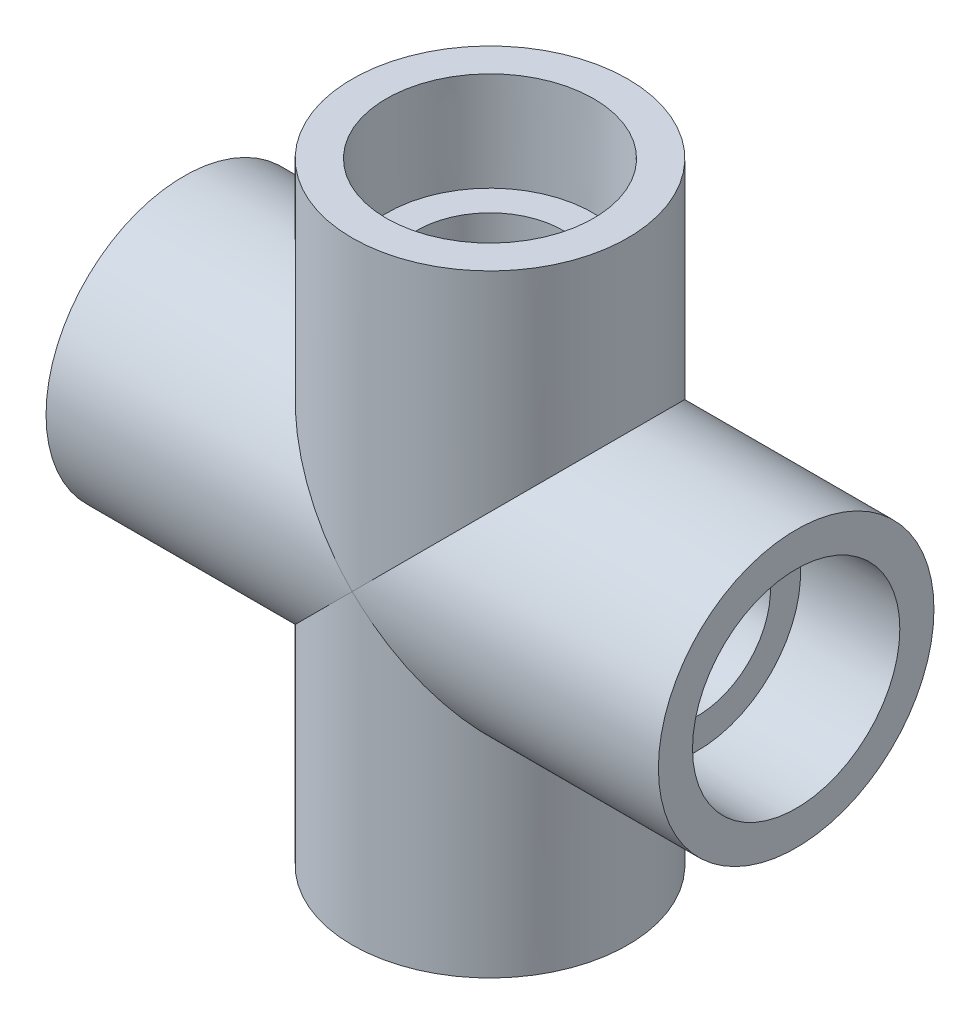
ISO-10303-21;
HEADER;
FILE_DESCRIPTION(('STEP AP214'),'2;1');
FILE_NAME('part.step','',(''),(''),'','','');
FILE_SCHEMA(('AUTOMOTIVE_DESIGN { 1 0 10303 214 1 1 1 1 }'));
ENDSEC;
DATA;
#1=APPLICATION_CONTEXT('core data for automotive mechanical design processes');
#2=APPLICATION_PROTOCOL_DEFINITION('international standard','automotive_design',2000,#1);
#3=PRODUCT_CONTEXT('',#1,'mechanical');
#4=PRODUCT('Part','Part','',(#3));
#5=PRODUCT_RELATED_PRODUCT_CATEGORY('part','',(#4));
#6=PRODUCT_DEFINITION_FORMATION('','',#4);
#7=PRODUCT_DEFINITION_CONTEXT('part definition',#1,'design');
#8=PRODUCT_DEFINITION('design','',#6,#7);
#9=PRODUCT_DEFINITION_SHAPE('','',#8);
#10=(LENGTH_UNIT() NAMED_UNIT(*) SI_UNIT(.MILLI.,.METRE.));
#11=(NAMED_UNIT(*) PLANE_ANGLE_UNIT() SI_UNIT($,.RADIAN.));
#12=(NAMED_UNIT(*) SI_UNIT($,.STERADIAN.) SOLID_ANGLE_UNIT());
#13=UNCERTAINTY_MEASURE_WITH_UNIT(LENGTH_MEASURE(1.E-05),#10,'distance_accuracy_value','');
#14=(GEOMETRIC_REPRESENTATION_CONTEXT(3) GLOBAL_UNCERTAINTY_ASSIGNED_CONTEXT((#13)) GLOBAL_UNIT_ASSIGNED_CONTEXT((#10,
#11,#12)) REPRESENTATION_CONTEXT('',''));
#15=CARTESIAN_POINT('',(0.,0.,0.));
#16=DIRECTION('',(0.,0.,1.));
#17=DIRECTION('',(1.,0.,0.));
#18=AXIS2_PLACEMENT_3D('',#15,#16,#17);
#19=CARTESIAN_POINT('',(-39.6875,-17.859375,0.));
#20=DIRECTION('',(-1.,0.,0.));
#21=DIRECTION('',(0.,0.,1.));
#22=AXIS2_PLACEMENT_3D('',#19,#20,#21);
#23=PLANE('',#22);
#24=CARTESIAN_POINT('',(-39.6875,0.,0.));
#25=DIRECTION('',(-1.,0.,0.));
#26=DIRECTION('',(0.,0.,1.));
#27=AXIS2_PLACEMENT_3D('',#24,#25,#26);
#28=CIRCLE('',#27,17.859375);
#29=CARTESIAN_POINT('',(-39.6875,0.,17.859375));
#30=VERTEX_POINT('',#29);
#31=EDGE_CURVE('E134',#30,#30,#28,.T.);
#32=ORIENTED_EDGE('',*,*,#31,.T.);
#33=EDGE_LOOP('',(#32));
#34=FACE_BOUND('',#33,.T.);
#35=CARTESIAN_POINT('',(-39.6875,0.,0.));
#36=DIRECTION('',(-1.,0.,0.));
#37=DIRECTION('',(0.,0.,1.));
#38=AXIS2_PLACEMENT_3D('',#35,#36,#37);
#39=CIRCLE('',#38,13.4366);
#40=CARTESIAN_POINT('',(-39.6875,0.,13.4366));
#41=VERTEX_POINT('',#40);
#42=EDGE_CURVE('E11',#41,#41,#39,.T.);
#43=ORIENTED_EDGE('',*,*,#42,.F.);
#44=EDGE_LOOP('',(#43));
#45=FACE_BOUND('',#44,.T.);
#46=ADVANCED_FACE('F41',(#34,#45),#23,.T.);
#47=CARTESIAN_POINT('',(-26.924,0.,0.));
#48=DIRECTION('',(-1.,0.,0.));
#49=DIRECTION('',(0.,0.,1.));
#50=AXIS2_PLACEMENT_3D('',#47,#48,#49);
#51=CONICAL_SURFACE('',#50,13.335,0.00796003087931212);
#52=ORIENTED_EDGE('',*,*,#42,.T.);
#53=EDGE_LOOP('',(#52));
#54=FACE_BOUND('',#53,.T.);
#55=CARTESIAN_POINT('',(-26.924,0.,0.));
#56=DIRECTION('',(-1.,0.,0.));
#57=DIRECTION('',(0.,0.,1.));
#58=AXIS2_PLACEMENT_3D('',#55,#56,#57);
#59=CIRCLE('',#58,13.335);
#60=CARTESIAN_POINT('',(-26.924,0.,13.335));
#61=VERTEX_POINT('',#60);
#62=EDGE_CURVE('E48',#61,#61,#59,.T.);
#63=ORIENTED_EDGE('',*,*,#62,.F.);
#64=EDGE_LOOP('',(#63));
#65=FACE_BOUND('',#64,.T.);
#66=ADVANCED_FACE('F145',(#54,#65),#51,.F.);
#67=CARTESIAN_POINT('',(-26.924,-9.4234,0.));
#68=DIRECTION('',(-1.,0.,0.));
#69=DIRECTION('',(0.,0.,1.));
#70=AXIS2_PLACEMENT_3D('',#67,#68,#69);
#71=PLANE('',#70);
#72=ORIENTED_EDGE('',*,*,#62,.T.);
#73=EDGE_LOOP('',(#72));
#74=FACE_BOUND('',#73,.T.);
#75=CARTESIAN_POINT('',(-26.924,0.,0.));
#76=DIRECTION('',(-1.,0.,0.));
#77=DIRECTION('',(0.,0.,1.));
#78=AXIS2_PLACEMENT_3D('',#75,#76,#77);
#79=CIRCLE('',#78,9.4234);
#80=CARTESIAN_POINT('',(-26.924,0.,9.4234));
#81=VERTEX_POINT('',#80);
#82=EDGE_CURVE('E137',#81,#81,#79,.T.);
#83=ORIENTED_EDGE('',*,*,#82,.F.);
#84=EDGE_LOOP('',(#83));
#85=FACE_BOUND('',#84,.T.);
#86=ADVANCED_FACE('F142',(#74,#85),#71,.T.);
#87=CARTESIAN_POINT('',(-39.6875,0.,0.));
#88=DIRECTION('',(-1.,0.,0.));
#89=DIRECTION('',(0.,0.,1.));
#90=AXIS2_PLACEMENT_3D('',#87,#88,#89);
#91=CYLINDRICAL_SURFACE('',#90,9.4234);
#92=CARTESIAN_POINT('',(0.,0.,0.));
#93=DIRECTION('',(0.70710678118655,-0.707106781186545,0.));
#94=DIRECTION('',(-0.707106781186545,-0.70710678118655,0.));
#95=AXIS2_PLACEMENT_3D('',#92,#93,#94);
#96=ELLIPSE('',#95,13.3267000836666,9.4234);
#97=CARTESIAN_POINT('',(0.,0.,9.4234));
#98=VERTEX_POINT('',#97);
#99=CARTESIAN_POINT('',(0.,0.,-9.4234));
#100=VERTEX_POINT('',#99);
#101=EDGE_CURVE('E66',#98,#100,#96,.T.);
#102=ORIENTED_EDGE('',*,*,#101,.T.);
#103=CARTESIAN_POINT('',(0.,0.,0.));
#104=DIRECTION('',(0.70710678118654,0.707106781186555,0.));
#105=DIRECTION('',(-0.707106781186555,0.70710678118654,0.));
#106=AXIS2_PLACEMENT_3D('',#103,#104,#105);
#107=ELLIPSE('',#106,13.3267000836666,9.4234);
#108=EDGE_CURVE('E54',#100,#98,#107,.T.);
#109=ORIENTED_EDGE('',*,*,#108,.T.);
#110=EDGE_LOOP('',(#102,#109));
#111=FACE_BOUND('',#110,.T.);
#112=ORIENTED_EDGE('',*,*,#82,.T.);
#113=EDGE_LOOP('',(#112));
#114=FACE_BOUND('',#113,.T.);
#115=ADVANCED_FACE('F68',(#111,#114),#91,.F.);
#116=CARTESIAN_POINT('',(-39.6875,0.,0.));
#117=DIRECTION('',(-1.,0.,0.));
#118=DIRECTION('',(0.,0.,1.));
#119=AXIS2_PLACEMENT_3D('',#116,#117,#118);
#120=CYLINDRICAL_SURFACE('',#119,17.859375);
#121=CARTESIAN_POINT('',(0.,0.,0.));
#122=DIRECTION('',(0.70710678118654,0.707106781186555,0.));
#123=DIRECTION('',(-0.707106781186555,0.70710678118654,0.));
#124=AXIS2_PLACEMENT_3D('',#121,#122,#123);
#125=ELLIPSE('',#124,25.256970340507,17.859375);
#126=CARTESIAN_POINT('',(0.,0.,17.859375));
#127=VERTEX_POINT('',#126);
#128=CARTESIAN_POINT('',(0.,0.,-17.859375));
#129=VERTEX_POINT('',#128);
#130=EDGE_CURVE('E61',#127,#129,#125,.F.);
#131=ORIENTED_EDGE('',*,*,#130,.T.);
#132=CARTESIAN_POINT('',(0.,0.,0.));
#133=DIRECTION('',(0.70710678118655,-0.707106781186545,0.));
#134=DIRECTION('',(-0.707106781186545,-0.70710678118655,0.));
#135=AXIS2_PLACEMENT_3D('',#132,#133,#134);
#136=ELLIPSE('',#135,25.256970340507,17.859375);
#137=EDGE_CURVE('E129',#129,#127,#136,.F.);
#138=ORIENTED_EDGE('',*,*,#137,.T.);
#139=EDGE_LOOP('',(#131,#138));
#140=FACE_BOUND('',#139,.T.);
#141=ORIENTED_EDGE('',*,*,#31,.F.);
#142=EDGE_LOOP('',(#141));
#143=FACE_BOUND('',#142,.T.);
#144=ADVANCED_FACE('F157',(#140,#143),#120,.T.);
#145=CARTESIAN_POINT('',(17.8593750000001,-39.6874999999999,0.));
#146=DIRECTION('',(0.,-1.,0.));
#147=DIRECTION('',(0.,0.,1.));
#148=AXIS2_PLACEMENT_3D('',#145,#146,#147);
#149=PLANE('',#148);
#150=CARTESIAN_POINT('',(1.38568165635337E-13,-39.6875,0.));
#151=DIRECTION('',(0.,-1.,0.));
#152=DIRECTION('',(0.,0.,1.));
#153=AXIS2_PLACEMENT_3D('',#150,#151,#152);
#154=CIRCLE('',#153,17.859375);
#155=CARTESIAN_POINT('',(1.38568165635337E-13,-39.6875,17.859375));
#156=VERTEX_POINT('',#155);
#157=EDGE_CURVE('E80',#156,#156,#154,.T.);
#158=ORIENTED_EDGE('',*,*,#157,.T.);
#159=EDGE_LOOP('',(#158));
#160=FACE_BOUND('',#159,.T.);
#161=CARTESIAN_POINT('',(1.38568165635337E-13,-39.6875,0.));
#162=DIRECTION('',(0.,-1.,0.));
#163=DIRECTION('',(0.,0.,1.));
#164=AXIS2_PLACEMENT_3D('',#161,#162,#163);
#165=CIRCLE('',#164,13.4366);
#166=CARTESIAN_POINT('',(1.38568165635337E-13,-39.6875,13.4366));
#167=VERTEX_POINT('',#166);
#168=EDGE_CURVE('E126',#167,#167,#165,.T.);
#169=ORIENTED_EDGE('',*,*,#168,.F.);
#170=EDGE_LOOP('',(#169));
#171=FACE_BOUND('',#170,.T.);
#172=ADVANCED_FACE('F160',(#160,#171),#149,.T.);
#173=CARTESIAN_POINT('',(0.,-26.924,0.));
#174=DIRECTION('',(0.,-1.,0.));
#175=DIRECTION('',(0.,0.,1.));
#176=AXIS2_PLACEMENT_3D('',#173,#174,#175);
#177=CONICAL_SURFACE('',#176,13.335,0.00796003087931212);
#178=ORIENTED_EDGE('',*,*,#168,.T.);
#179=EDGE_LOOP('',(#178));
#180=FACE_BOUND('',#179,.T.);
#181=CARTESIAN_POINT('',(0.,-26.924,0.));
#182=DIRECTION('',(0.,-1.,0.));
#183=DIRECTION('',(0.,0.,1.));
#184=AXIS2_PLACEMENT_3D('',#181,#182,#183);
#185=CIRCLE('',#184,13.335);
#186=CARTESIAN_POINT('',(0.,-26.924,13.335));
#187=VERTEX_POINT('',#186);
#188=EDGE_CURVE('E123',#187,#187,#185,.T.);
#189=ORIENTED_EDGE('',*,*,#188,.F.);
#190=EDGE_LOOP('',(#189));
#191=FACE_BOUND('',#190,.T.);
#192=ADVANCED_FACE('F163',(#180,#191),#177,.F.);
#193=CARTESIAN_POINT('',(9.42340000000009,-26.924,0.));
#194=DIRECTION('',(0.,-1.,0.));
#195=DIRECTION('',(0.,0.,1.));
#196=AXIS2_PLACEMENT_3D('',#193,#194,#195);
#197=PLANE('',#196);
#198=ORIENTED_EDGE('',*,*,#188,.T.);
#199=EDGE_LOOP('',(#198));
#200=FACE_BOUND('',#199,.T.);
#201=CARTESIAN_POINT('',(0.,-26.924,0.));
#202=DIRECTION('',(0.,-1.,0.));
#203=DIRECTION('',(0.,0.,1.));
#204=AXIS2_PLACEMENT_3D('',#201,#202,#203);
#205=CIRCLE('',#204,9.4234);
#206=CARTESIAN_POINT('',(0.,-26.924,9.4234));
#207=VERTEX_POINT('',#206);
#208=EDGE_CURVE('E120',#207,#207,#205,.T.);
#209=ORIENTED_EDGE('',*,*,#208,.F.);
#210=EDGE_LOOP('',(#209));
#211=FACE_BOUND('',#210,.T.);
#212=ADVANCED_FACE('F167',(#200,#211),#197,.T.);
#213=CARTESIAN_POINT('',(1.38568165635337E-13,-39.6875,0.));
#214=DIRECTION('',(0.,-1.,0.));
#215=DIRECTION('',(0.,0.,1.));
#216=AXIS2_PLACEMENT_3D('',#213,#214,#215);
#217=CYLINDRICAL_SURFACE('',#216,9.4234);
#218=CARTESIAN_POINT('',(0.,0.,0.));
#219=DIRECTION('',(-0.707106781186545,-0.70710678118655,0.));
#220=DIRECTION('',(0.70710678118655,-0.707106781186545,0.));
#221=AXIS2_PLACEMENT_3D('',#218,#219,#220);
#222=ELLIPSE('',#221,13.3267000836666,9.4234);
#223=EDGE_CURVE('E72',#100,#98,#222,.T.);
#224=ORIENTED_EDGE('',*,*,#223,.F.);
#225=ORIENTED_EDGE('',*,*,#101,.F.);
#226=EDGE_LOOP('',(#224,#225));
#227=FACE_BOUND('',#226,.T.);
#228=ORIENTED_EDGE('',*,*,#208,.T.);
#229=EDGE_LOOP('',(#228));
#230=FACE_BOUND('',#229,.T.);
#231=ADVANCED_FACE('F76',(#227,#230),#217,.F.);
#232=CARTESIAN_POINT('',(1.38568165635337E-13,-39.6875,0.));
#233=DIRECTION('',(0.,-1.,0.));
#234=DIRECTION('',(0.,0.,1.));
#235=AXIS2_PLACEMENT_3D('',#232,#233,#234);
#236=CYLINDRICAL_SURFACE('',#235,17.859375);
#237=ORIENTED_EDGE('',*,*,#137,.F.);
#238=CARTESIAN_POINT('',(0.,0.,0.));
#239=DIRECTION('',(-0.707106781186545,-0.70710678118655,0.));
#240=DIRECTION('',(0.70710678118655,-0.707106781186545,0.));
#241=AXIS2_PLACEMENT_3D('',#238,#239,#240);
#242=ELLIPSE('',#241,25.256970340507,17.859375);
#243=EDGE_CURVE('E131',#127,#129,#242,.F.);
#244=ORIENTED_EDGE('',*,*,#243,.F.);
#245=EDGE_LOOP('',(#237,#244));
#246=FACE_BOUND('',#245,.T.);
#247=ORIENTED_EDGE('',*,*,#157,.F.);
#248=EDGE_LOOP('',(#247));
#249=FACE_BOUND('',#248,.T.);
#250=ADVANCED_FACE('F174',(#246,#249),#236,.T.);
#251=CARTESIAN_POINT('',(39.6875,17.859375,0.));
#252=DIRECTION('',(1.,0.,0.));
#253=DIRECTION('',(0.,0.,1.));
#254=AXIS2_PLACEMENT_3D('',#251,#252,#253);
#255=PLANE('',#254);
#256=CARTESIAN_POINT('',(39.6875,0.,0.));
#257=DIRECTION('',(1.,0.,0.));
#258=DIRECTION('',(0.,0.,1.));
#259=AXIS2_PLACEMENT_3D('',#256,#257,#258);
#260=CIRCLE('',#259,17.859375);
#261=CARTESIAN_POINT('',(39.6875,0.,17.859375));
#262=VERTEX_POINT('',#261);
#263=EDGE_CURVE('E86',#262,#262,#260,.T.);
#264=ORIENTED_EDGE('',*,*,#263,.T.);
#265=EDGE_LOOP('',(#264));
#266=FACE_BOUND('',#265,.T.);
#267=CARTESIAN_POINT('',(39.6875,0.,0.));
#268=DIRECTION('',(1.,0.,0.));
#269=DIRECTION('',(0.,0.,1.));
#270=AXIS2_PLACEMENT_3D('',#267,#268,#269);
#271=CIRCLE('',#270,13.4366);
#272=CARTESIAN_POINT('',(39.6875,0.,13.4366));
#273=VERTEX_POINT('',#272);
#274=EDGE_CURVE('E113',#273,#273,#271,.T.);
#275=ORIENTED_EDGE('',*,*,#274,.F.);
#276=EDGE_LOOP('',(#275));
#277=FACE_BOUND('',#276,.T.);
#278=ADVANCED_FACE('F177',(#266,#277),#255,.T.);
#279=CARTESIAN_POINT('',(26.924,0.,0.));
#280=DIRECTION('',(1.,0.,0.));
#281=DIRECTION('',(0.,0.,1.));
#282=AXIS2_PLACEMENT_3D('',#279,#280,#281);
#283=CONICAL_SURFACE('',#282,13.335,0.00796003087931212);
#284=ORIENTED_EDGE('',*,*,#274,.T.);
#285=EDGE_LOOP('',(#284));
#286=FACE_BOUND('',#285,.T.);
#287=CARTESIAN_POINT('',(26.924,0.,0.));
#288=DIRECTION('',(1.,0.,0.));
#289=DIRECTION('',(0.,0.,1.));
#290=AXIS2_PLACEMENT_3D('',#287,#288,#289);
#291=CIRCLE('',#290,13.335);
#292=CARTESIAN_POINT('',(26.924,0.,13.335));
#293=VERTEX_POINT('',#292);
#294=EDGE_CURVE('E110',#293,#293,#291,.T.);
#295=ORIENTED_EDGE('',*,*,#294,.F.);
#296=EDGE_LOOP('',(#295));
#297=FACE_BOUND('',#296,.T.);
#298=ADVANCED_FACE('F181',(#286,#297),#283,.F.);
#299=CARTESIAN_POINT('',(26.924,9.4234,0.));
#300=DIRECTION('',(1.,0.,0.));
#301=DIRECTION('',(0.,0.,1.));
#302=AXIS2_PLACEMENT_3D('',#299,#300,#301);
#303=PLANE('',#302);
#304=ORIENTED_EDGE('',*,*,#294,.T.);
#305=EDGE_LOOP('',(#304));
#306=FACE_BOUND('',#305,.T.);
#307=CARTESIAN_POINT('',(26.924,0.,0.));
#308=DIRECTION('',(1.,0.,0.));
#309=DIRECTION('',(0.,0.,1.));
#310=AXIS2_PLACEMENT_3D('',#307,#308,#309);
#311=CIRCLE('',#310,9.4234);
#312=CARTESIAN_POINT('',(26.924,0.,9.4234));
#313=VERTEX_POINT('',#312);
#314=EDGE_CURVE('E107',#313,#313,#311,.T.);
#315=ORIENTED_EDGE('',*,*,#314,.F.);
#316=EDGE_LOOP('',(#315));
#317=FACE_BOUND('',#316,.T.);
#318=ADVANCED_FACE('F185',(#306,#317),#303,.T.);
#319=CARTESIAN_POINT('',(39.6875,0.,0.));
#320=DIRECTION('',(1.,0.,0.));
#321=DIRECTION('',(0.,0.,1.));
#322=AXIS2_PLACEMENT_3D('',#319,#320,#321);
#323=CYLINDRICAL_SURFACE('',#322,9.4234);
#324=CARTESIAN_POINT('',(0.,0.,0.));
#325=DIRECTION('',(0.707106781186547,-0.707106781186547,0.));
#326=DIRECTION('',(0.707106781186548,0.707106781186548,0.));
#327=AXIS2_PLACEMENT_3D('',#324,#325,#326);
#328=ELLIPSE('',#327,13.3267000836666,9.4234);
#329=EDGE_CURVE('E82',#100,#98,#328,.T.);
#330=ORIENTED_EDGE('',*,*,#329,.F.);
#331=ORIENTED_EDGE('',*,*,#223,.T.);
#332=EDGE_LOOP('',(#330,#331));
#333=FACE_BOUND('',#332,.T.);
#334=ORIENTED_EDGE('',*,*,#314,.T.);
#335=EDGE_LOOP('',(#334));
#336=FACE_BOUND('',#335,.T.);
#337=ADVANCED_FACE('F83',(#333,#336),#323,.F.);
#338=CARTESIAN_POINT('',(39.6875,0.,0.));
#339=DIRECTION('',(1.,0.,0.));
#340=DIRECTION('',(0.,0.,1.));
#341=AXIS2_PLACEMENT_3D('',#338,#339,#340);
#342=CYLINDRICAL_SURFACE('',#341,17.859375);
#343=ORIENTED_EDGE('',*,*,#243,.T.);
#344=CARTESIAN_POINT('',(0.,0.,0.));
#345=DIRECTION('',(0.707106781186547,-0.707106781186547,0.));
#346=DIRECTION('',(0.707106781186548,0.707106781186548,0.));
#347=AXIS2_PLACEMENT_3D('',#344,#345,#346);
#348=ELLIPSE('',#347,25.256970340507,17.859375);
#349=EDGE_CURVE('E73',#127,#129,#348,.F.);
#350=ORIENTED_EDGE('',*,*,#349,.F.);
#351=EDGE_LOOP('',(#343,#350));
#352=FACE_BOUND('',#351,.T.);
#353=ORIENTED_EDGE('',*,*,#263,.F.);
#354=EDGE_LOOP('',(#353));
#355=FACE_BOUND('',#354,.T.);
#356=ADVANCED_FACE('F192',(#352,#355),#342,.T.);
#357=CARTESIAN_POINT('',(-17.8593750000004,39.6874999999998,0.));
#358=DIRECTION('',(0.,1.,0.));
#359=DIRECTION('',(0.,0.,1.));
#360=AXIS2_PLACEMENT_3D('',#357,#358,#359);
#361=PLANE('',#360);
#362=CARTESIAN_POINT('',(-4.1570449690601E-13,39.6875,0.));
#363=DIRECTION('',(0.,1.,0.));
#364=DIRECTION('',(0.,0.,1.));
#365=AXIS2_PLACEMENT_3D('',#362,#363,#364);
#366=CIRCLE('',#365,17.859375);
#367=CARTESIAN_POINT('',(-4.1570449690601E-13,39.6875,17.859375));
#368=VERTEX_POINT('',#367);
#369=EDGE_CURVE('E90',#368,#368,#366,.T.);
#370=ORIENTED_EDGE('',*,*,#369,.T.);
#371=EDGE_LOOP('',(#370));
#372=FACE_BOUND('',#371,.T.);
#373=CARTESIAN_POINT('',(-4.15704496906011E-13,39.6875,0.));
#374=DIRECTION('',(0.,1.,0.));
#375=DIRECTION('',(0.,0.,1.));
#376=AXIS2_PLACEMENT_3D('',#373,#374,#375);
#377=CIRCLE('',#376,13.4366);
#378=CARTESIAN_POINT('',(-4.15704496906011E-13,39.6875,13.4366));
#379=VERTEX_POINT('',#378);
#380=EDGE_CURVE('E101',#379,#379,#377,.T.);
#381=ORIENTED_EDGE('',*,*,#380,.F.);
#382=EDGE_LOOP('',(#381));
#383=FACE_BOUND('',#382,.T.);
#384=ADVANCED_FACE('F195',(#372,#383),#361,.T.);
#385=CARTESIAN_POINT('',(-2.82013930701038E-13,26.924,0.));
#386=DIRECTION('',(0.,1.,0.));
#387=DIRECTION('',(0.,0.,1.));
#388=AXIS2_PLACEMENT_3D('',#385,#386,#387);
#389=CONICAL_SURFACE('',#388,13.335,0.00796003087931212);
#390=ORIENTED_EDGE('',*,*,#380,.T.);
#391=EDGE_LOOP('',(#390));
#392=FACE_BOUND('',#391,.T.);
#393=CARTESIAN_POINT('',(-2.82013930701038E-13,26.924,0.));
#394=DIRECTION('',(0.,1.,0.));
#395=DIRECTION('',(0.,0.,1.));
#396=AXIS2_PLACEMENT_3D('',#393,#394,#395);
#397=CIRCLE('',#396,13.335);
#398=CARTESIAN_POINT('',(-2.82013930701038E-13,26.924,13.335));
#399=VERTEX_POINT('',#398);
#400=EDGE_CURVE('E98',#399,#399,#397,.T.);
#401=ORIENTED_EDGE('',*,*,#400,.F.);
#402=EDGE_LOOP('',(#401));
#403=FACE_BOUND('',#402,.T.);
#404=ADVANCED_FACE('F199',(#392,#403),#389,.F.);
#405=CARTESIAN_POINT('',(-9.42340000000028,26.9239999999999,0.));
#406=DIRECTION('',(0.,1.,0.));
#407=DIRECTION('',(0.,0.,1.));
#408=AXIS2_PLACEMENT_3D('',#405,#406,#407);
#409=PLANE('',#408);
#410=ORIENTED_EDGE('',*,*,#400,.T.);
#411=EDGE_LOOP('',(#410));
#412=FACE_BOUND('',#411,.T.);
#413=CARTESIAN_POINT('',(-2.82013930701038E-13,26.924,0.));
#414=DIRECTION('',(0.,1.,0.));
#415=DIRECTION('',(0.,0.,1.));
#416=AXIS2_PLACEMENT_3D('',#413,#414,#415);
#417=CIRCLE('',#416,9.4234);
#418=CARTESIAN_POINT('',(-2.82013930701038E-13,26.924,9.4234));
#419=VERTEX_POINT('',#418);
#420=EDGE_CURVE('E93',#419,#419,#417,.T.);
#421=ORIENTED_EDGE('',*,*,#420,.F.);
#422=EDGE_LOOP('',(#421));
#423=FACE_BOUND('',#422,.T.);
#424=ADVANCED_FACE('F203',(#412,#423),#409,.T.);
#425=CARTESIAN_POINT('',(-4.15704496906011E-13,39.6875,0.));
#426=DIRECTION('',(0.,1.,0.));
#427=DIRECTION('',(0.,0.,1.));
#428=AXIS2_PLACEMENT_3D('',#425,#426,#427);
#429=CYLINDRICAL_SURFACE('',#428,9.4234);
#430=ORIENTED_EDGE('',*,*,#108,.F.);
#431=ORIENTED_EDGE('',*,*,#329,.T.);
#432=EDGE_LOOP('',(#430,#431));
#433=FACE_BOUND('',#432,.T.);
#434=ORIENTED_EDGE('',*,*,#420,.T.);
#435=EDGE_LOOP('',(#434));
#436=FACE_BOUND('',#435,.T.);
#437=ADVANCED_FACE('F88',(#433,#436),#429,.F.);
#438=CARTESIAN_POINT('',(-4.15704496906011E-13,39.6875,0.));
#439=DIRECTION('',(0.,1.,0.));
#440=DIRECTION('',(0.,0.,1.));
#441=AXIS2_PLACEMENT_3D('',#438,#439,#440);
#442=CYLINDRICAL_SURFACE('',#441,17.859375);
#443=ORIENTED_EDGE('',*,*,#349,.T.);
#444=ORIENTED_EDGE('',*,*,#130,.F.);
#445=EDGE_LOOP('',(#443,#444));
#446=FACE_BOUND('',#445,.T.);
#447=ORIENTED_EDGE('',*,*,#369,.F.);
#448=EDGE_LOOP('',(#447));
#449=FACE_BOUND('',#448,.T.);
#450=ADVANCED_FACE('F210',(#446,#449),#442,.T.);
#451=CLOSED_SHELL('',(#46,#66,#86,#115,#144,#172,#192,#212,#231,#250,#278,#298,#318,#337,#356,
#384,#404,#424,#437,#450));
#452=MANIFOLD_SOLID_BREP('B2',#451);
#453=ADVANCED_BREP_SHAPE_REPRESENTATION('',(#18,#452),#14);
#454=SHAPE_DEFINITION_REPRESENTATION(#9,#453);
ENDSEC;
END-ISO-10303-21;
